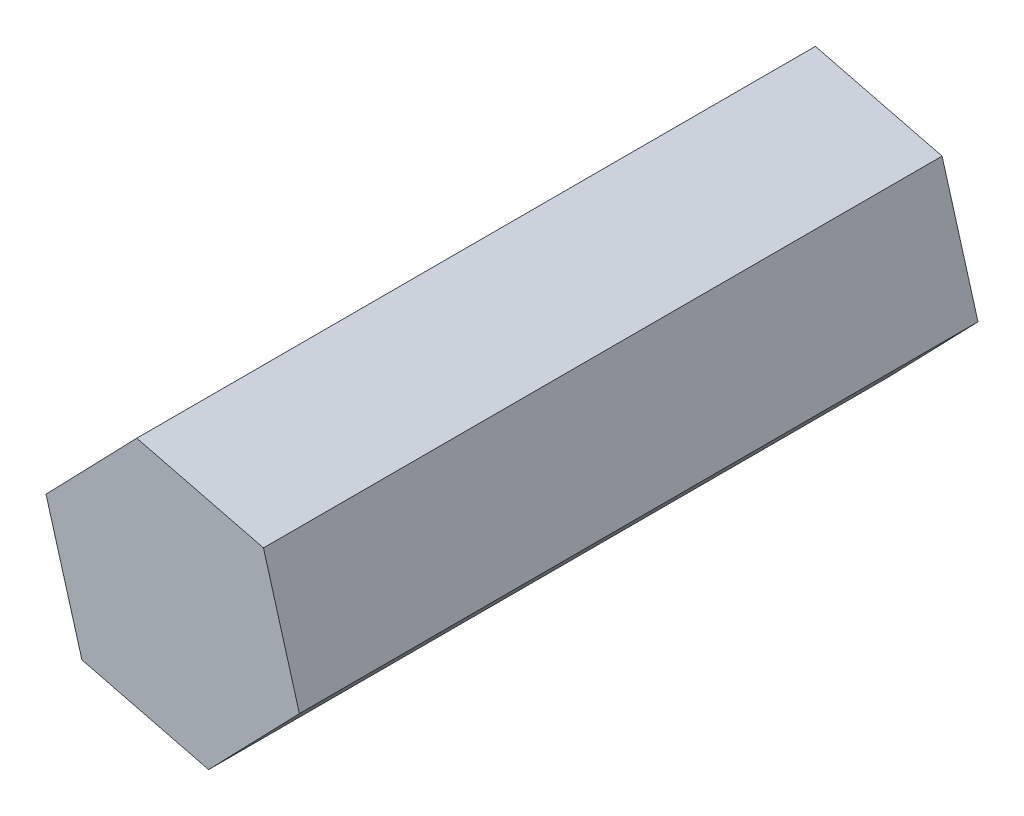
ISO-10303-21;
HEADER;
FILE_DESCRIPTION(('STEP AP214'),'2;1');
FILE_NAME('part.step','',(''),(''),'','','');
FILE_SCHEMA(('AUTOMOTIVE_DESIGN { 1 0 10303 214 1 1 1 1 }'));
ENDSEC;
DATA;
#1=APPLICATION_CONTEXT('core data for automotive mechanical design processes');
#2=APPLICATION_PROTOCOL_DEFINITION('international standard','automotive_design',2000,#1);
#3=PRODUCT_CONTEXT('',#1,'mechanical');
#4=PRODUCT('Part','Part','',(#3));
#5=PRODUCT_RELATED_PRODUCT_CATEGORY('part','',(#4));
#6=PRODUCT_DEFINITION_FORMATION('','',#4);
#7=PRODUCT_DEFINITION_CONTEXT('part definition',#1,'design');
#8=PRODUCT_DEFINITION('design','',#6,#7);
#9=PRODUCT_DEFINITION_SHAPE('','',#8);
#10=(LENGTH_UNIT() NAMED_UNIT(*) SI_UNIT(.MILLI.,.METRE.));
#11=(NAMED_UNIT(*) PLANE_ANGLE_UNIT() SI_UNIT($,.RADIAN.));
#12=(NAMED_UNIT(*) SI_UNIT($,.STERADIAN.) SOLID_ANGLE_UNIT());
#13=UNCERTAINTY_MEASURE_WITH_UNIT(LENGTH_MEASURE(1.E-05),#10,'distance_accuracy_value','');
#14=(GEOMETRIC_REPRESENTATION_CONTEXT(3) GLOBAL_UNCERTAINTY_ASSIGNED_CONTEXT((#13)) GLOBAL_UNIT_ASSIGNED_CONTEXT((#10,
#11,#12)) REPRESENTATION_CONTEXT('',''));
#15=CARTESIAN_POINT('',(0.,0.,0.));
#16=DIRECTION('',(0.,0.,1.));
#17=DIRECTION('',(1.,0.,0.));
#18=AXIS2_PLACEMENT_3D('',#15,#16,#17);
#19=CARTESIAN_POINT('',(-2.01661019445048,7.04958272928063,38.1));
#20=DIRECTION('',(0.718900237898645,-0.695113262676862,0.));
#21=DIRECTION('',(0.695113262676862,0.718900237898645,0.));
#22=AXIS2_PLACEMENT_3D('',#19,#20,#21);
#23=PLANE('',#22);
#24=DIRECTION('',(-0.695113262676862,-0.718900237898645,0.));
#25=VECTOR('',#24,1.);
#26=CARTESIAN_POINT('',(-2.01661019445048,7.04958272928063,0.));
#27=LINE('',#26,#25);
#28=CARTESIAN_POINT('',(-2.01661019445048,7.04958272928063,0.));
#29=VERTEX_POINT('',#28);
#30=CARTESIAN_POINT('',(-7.1134228268623,1.77835570671552,0.));
#31=VERTEX_POINT('',#30);
#32=EDGE_CURVE('E122',#29,#31,#27,.T.);
#33=ORIENTED_EDGE('',*,*,#32,.T.);
#34=DIRECTION('',(0.,0.,-1.));
#35=VECTOR('',#34,1.);
#36=CARTESIAN_POINT('',(-7.1134228268623,1.77835570671552,38.1));
#37=LINE('',#36,#35);
#38=CARTESIAN_POINT('',(-7.1134228268623,1.77835570671552,38.1));
#39=VERTEX_POINT('',#38);
#40=EDGE_CURVE('E11',#39,#31,#37,.T.);
#41=ORIENTED_EDGE('',*,*,#40,.F.);
#42=DIRECTION('',(-0.695113262676862,-0.718900237898645,0.));
#43=VECTOR('',#42,1.);
#44=CARTESIAN_POINT('',(-2.01661019445048,7.04958272928063,38.1));
#45=LINE('',#44,#43);
#46=CARTESIAN_POINT('',(-2.01661019445048,7.04958272928063,38.1));
#47=VERTEX_POINT('',#46);
#48=EDGE_CURVE('E133',#47,#39,#45,.T.);
#49=ORIENTED_EDGE('',*,*,#48,.F.);
#50=DIRECTION('',(0.,0.,-1.));
#51=VECTOR('',#50,1.);
#52=CARTESIAN_POINT('',(-2.01661019445048,7.04958272928063,38.1));
#53=LINE('',#52,#51);
#54=EDGE_CURVE('E118',#47,#29,#53,.T.);
#55=ORIENTED_EDGE('',*,*,#54,.T.);
#56=EDGE_LOOP('',(#33,#41,#49,#55));
#57=FACE_BOUND('',#56,.T.);
#58=ADVANCED_FACE('F38',(#57),#23,.F.);
#59=CARTESIAN_POINT('',(-7.1134228268623,1.77835570671552,38.1));
#60=DIRECTION('',(0.96143586293497,0.275029237468472,0.));
#61=DIRECTION('',(-0.275029237468472,0.96143586293497,0.));
#62=AXIS2_PLACEMENT_3D('',#59,#60,#61);
#63=PLANE('',#62);
#64=DIRECTION('',(0.275029237468472,-0.96143586293497,0.));
#65=VECTOR('',#64,1.);
#66=CARTESIAN_POINT('',(-7.1134228268623,1.77835570671552,0.));
#67=LINE('',#66,#65);
#68=CARTESIAN_POINT('',(-5.09681263241182,-5.27122702256511,0.));
#69=VERTEX_POINT('',#68);
#70=EDGE_CURVE('E125',#31,#69,#67,.T.);
#71=ORIENTED_EDGE('',*,*,#70,.T.);
#72=DIRECTION('',(0.,0.,-1.));
#73=VECTOR('',#72,1.);
#74=CARTESIAN_POINT('',(-5.09681263241182,-5.27122702256511,38.1));
#75=LINE('',#74,#73);
#76=CARTESIAN_POINT('',(-5.09681263241182,-5.27122702256511,38.1));
#77=VERTEX_POINT('',#76);
#78=EDGE_CURVE('E46',#77,#69,#75,.T.);
#79=ORIENTED_EDGE('',*,*,#78,.F.);
#80=DIRECTION('',(0.275029237468472,-0.96143586293497,0.));
#81=VECTOR('',#80,1.);
#82=CARTESIAN_POINT('',(-7.1134228268623,1.77835570671552,38.1));
#83=LINE('',#82,#81);
#84=EDGE_CURVE('E91',#39,#77,#83,.T.);
#85=ORIENTED_EDGE('',*,*,#84,.F.);
#86=ORIENTED_EDGE('',*,*,#40,.T.);
#87=EDGE_LOOP('',(#71,#79,#85,#86));
#88=FACE_BOUND('',#87,.T.);
#89=ADVANCED_FACE('F157',(#88),#63,.F.);
#90=CARTESIAN_POINT('',(-5.09681263241182,-5.27122702256511,38.1));
#91=DIRECTION('',(0.242535625036325,0.970142500145334,0.));
#92=DIRECTION('',(-0.970142500145334,0.242535625036325,0.));
#93=AXIS2_PLACEMENT_3D('',#90,#91,#92);
#94=PLANE('',#93);
#95=DIRECTION('',(0.970142500145334,-0.242535625036325,0.));
#96=VECTOR('',#95,1.);
#97=CARTESIAN_POINT('',(-5.09681263241182,-5.27122702256511,0.));
#98=LINE('',#97,#96);
#99=CARTESIAN_POINT('',(2.01661019445049,-7.04958272928063,0.));
#100=VERTEX_POINT('',#99);
#101=EDGE_CURVE('E128',#69,#100,#98,.T.);
#102=ORIENTED_EDGE('',*,*,#101,.T.);
#103=DIRECTION('',(0.,0.,-1.));
#104=VECTOR('',#103,1.);
#105=CARTESIAN_POINT('',(2.01661019445049,-7.04958272928063,38.1));
#106=LINE('',#105,#104);
#107=CARTESIAN_POINT('',(2.01661019445049,-7.04958272928063,38.1));
#108=VERTEX_POINT('',#107);
#109=EDGE_CURVE('E113',#108,#100,#106,.T.);
#110=ORIENTED_EDGE('',*,*,#109,.F.);
#111=DIRECTION('',(0.970142500145334,-0.242535625036325,0.));
#112=VECTOR('',#111,1.);
#113=CARTESIAN_POINT('',(-5.09681263241182,-5.27122702256511,38.1));
#114=LINE('',#113,#112);
#115=EDGE_CURVE('E104',#77,#108,#114,.T.);
#116=ORIENTED_EDGE('',*,*,#115,.F.);
#117=ORIENTED_EDGE('',*,*,#78,.T.);
#118=EDGE_LOOP('',(#102,#110,#116,#117));
#119=FACE_BOUND('',#118,.T.);
#120=ADVANCED_FACE('F139',(#119),#94,.F.);
#121=CARTESIAN_POINT('',(2.01661019445049,-7.04958272928063,38.1));
#122=DIRECTION('',(-0.718900237898645,0.695113262676862,0.));
#123=DIRECTION('',(-0.695113262676862,-0.718900237898645,0.));
#124=AXIS2_PLACEMENT_3D('',#121,#122,#123);
#125=PLANE('',#124);
#126=DIRECTION('',(0.695113262676862,0.718900237898645,0.));
#127=VECTOR('',#126,1.);
#128=CARTESIAN_POINT('',(2.01661019445049,-7.04958272928063,0.));
#129=LINE('',#128,#127);
#130=CARTESIAN_POINT('',(7.1134228268623,-1.77835570671552,0.));
#131=VERTEX_POINT('',#130);
#132=EDGE_CURVE('E112',#100,#131,#129,.T.);
#133=ORIENTED_EDGE('',*,*,#132,.T.);
#134=DIRECTION('',(0.,0.,-1.));
#135=VECTOR('',#134,1.);
#136=CARTESIAN_POINT('',(7.1134228268623,-1.77835570671552,38.1));
#137=LINE('',#136,#135);
#138=CARTESIAN_POINT('',(7.1134228268623,-1.77835570671552,38.1));
#139=VERTEX_POINT('',#138);
#140=EDGE_CURVE('E109',#139,#131,#137,.T.);
#141=ORIENTED_EDGE('',*,*,#140,.F.);
#142=DIRECTION('',(0.695113262676862,0.718900237898645,0.));
#143=VECTOR('',#142,1.);
#144=CARTESIAN_POINT('',(2.01661019445049,-7.04958272928063,38.1));
#145=LINE('',#144,#143);
#146=EDGE_CURVE('E98',#108,#139,#145,.T.);
#147=ORIENTED_EDGE('',*,*,#146,.F.);
#148=ORIENTED_EDGE('',*,*,#109,.T.);
#149=EDGE_LOOP('',(#133,#141,#147,#148));
#150=FACE_BOUND('',#149,.T.);
#151=ADVANCED_FACE('F110',(#150),#125,.F.);
#152=CARTESIAN_POINT('',(7.1134228268623,-1.77835570671552,38.1));
#153=DIRECTION('',(-0.96143586293497,-0.275029237468472,0.));
#154=DIRECTION('',(0.275029237468472,-0.96143586293497,0.));
#155=AXIS2_PLACEMENT_3D('',#152,#153,#154);
#156=PLANE('',#155);
#157=DIRECTION('',(-0.275029237468472,0.96143586293497,0.));
#158=VECTOR('',#157,1.);
#159=CARTESIAN_POINT('',(7.1134228268623,-1.77835570671552,0.));
#160=LINE('',#159,#158);
#161=CARTESIAN_POINT('',(5.09681263241182,5.27122702256512,0.));
#162=VERTEX_POINT('',#161);
#163=EDGE_CURVE('E77',#131,#162,#160,.T.);
#164=ORIENTED_EDGE('',*,*,#163,.T.);
#165=DIRECTION('',(0.,0.,-1.));
#166=VECTOR('',#165,1.);
#167=CARTESIAN_POINT('',(5.09681263241182,5.27122702256512,38.1));
#168=LINE('',#167,#166);
#169=CARTESIAN_POINT('',(5.09681263241182,5.27122702256512,38.1));
#170=VERTEX_POINT('',#169);
#171=EDGE_CURVE('E114',#170,#162,#168,.T.);
#172=ORIENTED_EDGE('',*,*,#171,.F.);
#173=DIRECTION('',(-0.275029237468472,0.96143586293497,0.));
#174=VECTOR('',#173,1.);
#175=CARTESIAN_POINT('',(7.1134228268623,-1.77835570671552,38.1));
#176=LINE('',#175,#174);
#177=EDGE_CURVE('E102',#139,#170,#176,.T.);
#178=ORIENTED_EDGE('',*,*,#177,.F.);
#179=ORIENTED_EDGE('',*,*,#140,.T.);
#180=EDGE_LOOP('',(#164,#172,#178,#179));
#181=FACE_BOUND('',#180,.T.);
#182=ADVANCED_FACE('F116',(#181),#156,.F.);
#183=CARTESIAN_POINT('',(5.09681263241182,5.27122702256512,38.1));
#184=DIRECTION('',(-0.242535625036325,-0.970142500145334,0.));
#185=DIRECTION('',(0.970142500145334,-0.242535625036325,0.));
#186=AXIS2_PLACEMENT_3D('',#183,#184,#185);
#187=PLANE('',#186);
#188=DIRECTION('',(-0.970142500145334,0.242535625036325,0.));
#189=VECTOR('',#188,1.);
#190=CARTESIAN_POINT('',(5.09681263241182,5.27122702256512,0.));
#191=LINE('',#190,#189);
#192=EDGE_CURVE('E83',#162,#29,#191,.T.);
#193=ORIENTED_EDGE('',*,*,#192,.T.);
#194=ORIENTED_EDGE('',*,*,#54,.F.);
#195=DIRECTION('',(-0.970142500145334,0.242535625036325,0.));
#196=VECTOR('',#195,1.);
#197=CARTESIAN_POINT('',(5.09681263241182,5.27122702256512,38.1));
#198=LINE('',#197,#196);
#199=EDGE_CURVE('E54',#170,#47,#198,.T.);
#200=ORIENTED_EDGE('',*,*,#199,.F.);
#201=ORIENTED_EDGE('',*,*,#171,.T.);
#202=EDGE_LOOP('',(#193,#194,#200,#201));
#203=FACE_BOUND('',#202,.T.);
#204=ADVANCED_FACE('F146',(#203),#187,.F.);
#205=CARTESIAN_POINT('',(0.,0.,38.1));
#206=DIRECTION('',(0.,0.,1.));
#207=DIRECTION('',(1.,0.,0.));
#208=AXIS2_PLACEMENT_3D('',#205,#206,#207);
#209=PLANE('',#208);
#210=ORIENTED_EDGE('',*,*,#48,.T.);
#211=ORIENTED_EDGE('',*,*,#84,.T.);
#212=ORIENTED_EDGE('',*,*,#115,.T.);
#213=ORIENTED_EDGE('',*,*,#146,.T.);
#214=ORIENTED_EDGE('',*,*,#177,.T.);
#215=ORIENTED_EDGE('',*,*,#199,.T.);
#216=EDGE_LOOP('',(#210,#211,#212,#213,#214,#215));
#217=FACE_BOUND('',#216,.T.);
#218=ADVANCED_FACE('F100',(#217),#209,.T.);
#219=CARTESIAN_POINT('',(0.,0.,0.));
#220=DIRECTION('',(0.,0.,1.));
#221=DIRECTION('',(1.,0.,0.));
#222=AXIS2_PLACEMENT_3D('',#219,#220,#221);
#223=PLANE('',#222);
#224=CARTESIAN_POINT('',(0.,0.,0.));
#225=DIRECTION('',(0.,0.,-1.));
#226=DIRECTION('',(-1.,0.,0.));
#227=AXIS2_PLACEMENT_3D('',#224,#225,#226);
#228=CIRCLE('',#227,1.82202413061008);
#229=CARTESIAN_POINT('',(-1.82202413061008,0.,0.));
#230=VERTEX_POINT('',#229);
#231=EDGE_CURVE('E219',#230,#230,#228,.T.);
#232=ORIENTED_EDGE('',*,*,#231,.F.);
#233=EDGE_LOOP('',(#232));
#234=FACE_BOUND('',#233,.T.);
#235=ORIENTED_EDGE('',*,*,#32,.F.);
#236=ORIENTED_EDGE('',*,*,#192,.F.);
#237=ORIENTED_EDGE('',*,*,#163,.F.);
#238=ORIENTED_EDGE('',*,*,#132,.F.);
#239=ORIENTED_EDGE('',*,*,#101,.F.);
#240=ORIENTED_EDGE('',*,*,#70,.F.);
#241=EDGE_LOOP('',(#235,#236,#237,#238,#239,#240));
#242=FACE_BOUND('',#241,.T.);
#243=ADVANCED_FACE('F142',(#234,#242),#223,.F.);
#244=CARTESIAN_POINT('',(0.,0.,2.54));
#245=DIRECTION('',(0.,0.,-1.));
#246=DIRECTION('',(-1.,0.,0.));
#247=AXIS2_PLACEMENT_3D('',#244,#245,#246);
#248=CYLINDRICAL_SURFACE('',#247,1.82202413061008);
#249=CARTESIAN_POINT('',(0.,0.,2.54));
#250=DIRECTION('',(0.,0.,-1.));
#251=DIRECTION('',(-1.,0.,0.));
#252=AXIS2_PLACEMENT_3D('',#249,#250,#251);
#253=CIRCLE('',#252,1.82202413061008);
#254=CARTESIAN_POINT('',(-1.82202413061008,0.,2.54));
#255=VERTEX_POINT('',#254);
#256=EDGE_CURVE('E126',#255,#255,#253,.T.);
#257=ORIENTED_EDGE('',*,*,#256,.F.);
#258=EDGE_LOOP('',(#257));
#259=FACE_BOUND('',#258,.T.);
#260=ORIENTED_EDGE('',*,*,#231,.T.);
#261=EDGE_LOOP('',(#260));
#262=FACE_BOUND('',#261,.T.);
#263=ADVANCED_FACE('F194',(#259,#262),#248,.F.);
#264=CARTESIAN_POINT('',(0.,0.,2.54));
#265=DIRECTION('',(0.,0.,-1.));
#266=DIRECTION('',(-1.,0.,0.));
#267=AXIS2_PLACEMENT_3D('',#264,#265,#266);
#268=PLANE('',#267);
#269=ORIENTED_EDGE('',*,*,#256,.T.);
#270=EDGE_LOOP('',(#269));
#271=FACE_BOUND('',#270,.T.);
#272=ADVANCED_FACE('F203',(#271),#268,.T.);
#273=CLOSED_SHELL('',(#58,#89,#120,#151,#182,#204,#218,#243,#263,#272));
#274=MANIFOLD_SOLID_BREP('B2',#273);
#275=ADVANCED_BREP_SHAPE_REPRESENTATION('',(#18,#274),#14);
#276=SHAPE_DEFINITION_REPRESENTATION(#9,#275);
ENDSEC;
END-ISO-10303-21;
